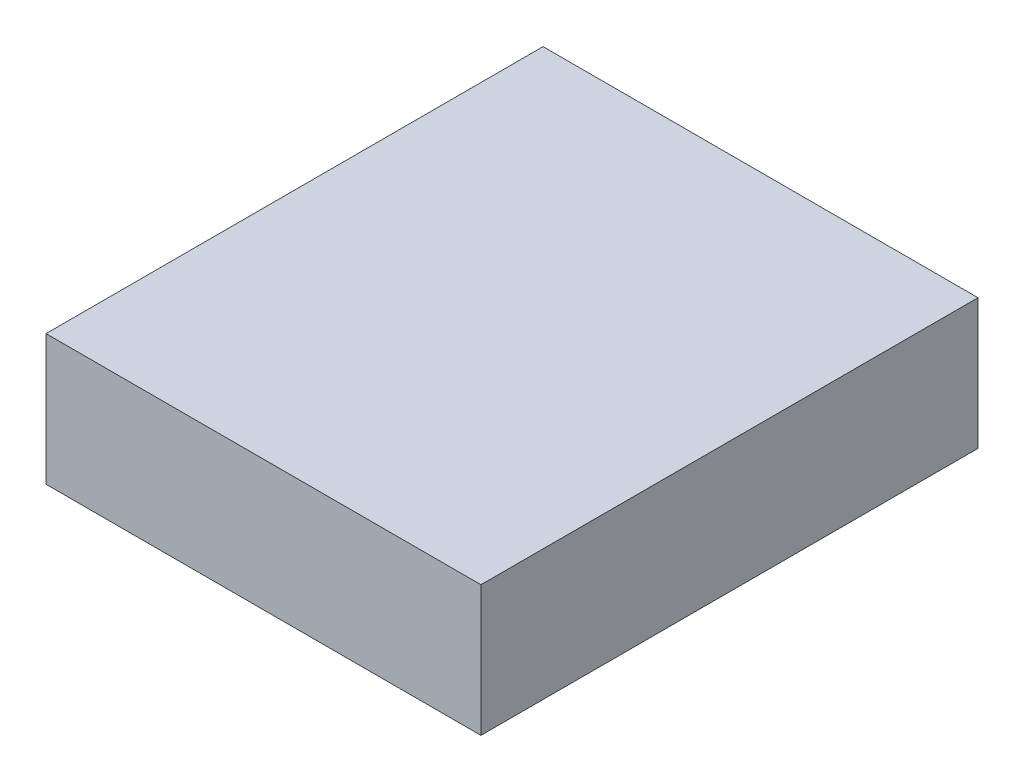
ISO-10303-21;
HEADER;
FILE_DESCRIPTION(('STEP AP214'),'2;1');
FILE_NAME('part.step','',(''),(''),'','','');
FILE_SCHEMA(('AUTOMOTIVE_DESIGN { 1 0 10303 214 1 1 1 1 }'));
ENDSEC;
DATA;
#1=APPLICATION_CONTEXT('core data for automotive mechanical design processes');
#2=APPLICATION_PROTOCOL_DEFINITION('international standard','automotive_design',2000,#1);
#3=PRODUCT_CONTEXT('',#1,'mechanical');
#4=PRODUCT('Part','Part','',(#3));
#5=PRODUCT_RELATED_PRODUCT_CATEGORY('part','',(#4));
#6=PRODUCT_DEFINITION_FORMATION('','',#4);
#7=PRODUCT_DEFINITION_CONTEXT('part definition',#1,'design');
#8=PRODUCT_DEFINITION('design','',#6,#7);
#9=PRODUCT_DEFINITION_SHAPE('','',#8);
#10=(LENGTH_UNIT() NAMED_UNIT(*) SI_UNIT(.MILLI.,.METRE.));
#11=(NAMED_UNIT(*) PLANE_ANGLE_UNIT() SI_UNIT($,.RADIAN.));
#12=(NAMED_UNIT(*) SI_UNIT($,.STERADIAN.) SOLID_ANGLE_UNIT());
#13=UNCERTAINTY_MEASURE_WITH_UNIT(LENGTH_MEASURE(1.E-05),#10,'distance_accuracy_value','');
#14=(GEOMETRIC_REPRESENTATION_CONTEXT(3) GLOBAL_UNCERTAINTY_ASSIGNED_CONTEXT((#13)) GLOBAL_UNIT_ASSIGNED_CONTEXT((#10,
#11,#12)) REPRESENTATION_CONTEXT('',''));
#15=CARTESIAN_POINT('',(0.,0.,0.));
#16=DIRECTION('',(0.,0.,1.));
#17=DIRECTION('',(1.,0.,0.));
#18=AXIS2_PLACEMENT_3D('',#15,#16,#17);
#19=CARTESIAN_POINT('',(-1.75,1.05,-2.));
#20=DIRECTION('',(1.,0.,0.));
#21=DIRECTION('',(0.,0.,-1.));
#22=AXIS2_PLACEMENT_3D('',#19,#20,#21);
#23=PLANE('',#22);
#24=DIRECTION('',(0.,0.,1.));
#25=VECTOR('',#24,1.);
#26=CARTESIAN_POINT('',(-1.75,0.,-2.));
#27=LINE('',#26,#25);
#28=CARTESIAN_POINT('',(-1.75,0.,-2.));
#29=VERTEX_POINT('',#28);
#30=CARTESIAN_POINT('',(-1.75,0.,2.));
#31=VERTEX_POINT('',#30);
#32=EDGE_CURVE('E96',#29,#31,#27,.T.);
#33=ORIENTED_EDGE('',*,*,#32,.T.);
#34=DIRECTION('',(0.,-1.,0.));
#35=VECTOR('',#34,1.);
#36=CARTESIAN_POINT('',(-1.75,1.05,2.));
#37=LINE('',#36,#35);
#38=CARTESIAN_POINT('',(-1.75,1.05,2.));
#39=VERTEX_POINT('',#38);
#40=EDGE_CURVE('E11',#39,#31,#37,.T.);
#41=ORIENTED_EDGE('',*,*,#40,.F.);
#42=DIRECTION('',(0.,0.,1.));
#43=VECTOR('',#42,1.);
#44=CARTESIAN_POINT('',(-1.75,1.05,-2.));
#45=LINE('',#44,#43);
#46=CARTESIAN_POINT('',(-1.75,1.05,-2.));
#47=VERTEX_POINT('',#46);
#48=EDGE_CURVE('E84',#47,#39,#45,.T.);
#49=ORIENTED_EDGE('',*,*,#48,.F.);
#50=DIRECTION('',(0.,-1.,0.));
#51=VECTOR('',#50,1.);
#52=CARTESIAN_POINT('',(-1.75,1.05,-2.));
#53=LINE('',#52,#51);
#54=EDGE_CURVE('E92',#47,#29,#53,.T.);
#55=ORIENTED_EDGE('',*,*,#54,.T.);
#56=EDGE_LOOP('',(#33,#41,#49,#55));
#57=FACE_BOUND('',#56,.T.);
#58=ADVANCED_FACE('F33',(#57),#23,.F.);
#59=CARTESIAN_POINT('',(1.75,1.05,2.));
#60=DIRECTION('',(0.,0.,-1.));
#61=DIRECTION('',(-1.,0.,0.));
#62=AXIS2_PLACEMENT_3D('',#59,#60,#61);
#63=PLANE('',#62);
#64=DIRECTION('',(1.,0.,0.));
#65=VECTOR('',#64,1.);
#66=CARTESIAN_POINT('',(1.75,0.,2.));
#67=LINE('',#66,#65);
#68=CARTESIAN_POINT('',(1.75,0.,2.));
#69=VERTEX_POINT('',#68);
#70=EDGE_CURVE('E88',#31,#69,#67,.T.);
#71=ORIENTED_EDGE('',*,*,#70,.T.);
#72=DIRECTION('',(0.,-1.,0.));
#73=VECTOR('',#72,1.);
#74=CARTESIAN_POINT('',(1.75,1.05,2.));
#75=LINE('',#74,#73);
#76=CARTESIAN_POINT('',(1.75,1.05,2.));
#77=VERTEX_POINT('',#76);
#78=EDGE_CURVE('E41',#77,#69,#75,.T.);
#79=ORIENTED_EDGE('',*,*,#78,.F.);
#80=DIRECTION('',(1.,0.,0.));
#81=VECTOR('',#80,1.);
#82=CARTESIAN_POINT('',(1.75,1.05,2.));
#83=LINE('',#82,#81);
#84=EDGE_CURVE('E79',#39,#77,#83,.T.);
#85=ORIENTED_EDGE('',*,*,#84,.F.);
#86=ORIENTED_EDGE('',*,*,#40,.T.);
#87=EDGE_LOOP('',(#71,#79,#85,#86));
#88=FACE_BOUND('',#87,.T.);
#89=ADVANCED_FACE('F87',(#88),#63,.F.);
#90=CARTESIAN_POINT('',(1.75,1.05,-2.));
#91=DIRECTION('',(-1.,0.,0.));
#92=DIRECTION('',(0.,0.,1.));
#93=AXIS2_PLACEMENT_3D('',#90,#91,#92);
#94=PLANE('',#93);
#95=DIRECTION('',(0.,0.,-1.));
#96=VECTOR('',#95,1.);
#97=CARTESIAN_POINT('',(1.75,0.,-2.));
#98=LINE('',#97,#96);
#99=CARTESIAN_POINT('',(1.75,0.,-2.));
#100=VERTEX_POINT('',#99);
#101=EDGE_CURVE('E66',#69,#100,#98,.T.);
#102=ORIENTED_EDGE('',*,*,#101,.T.);
#103=DIRECTION('',(0.,-1.,0.));
#104=VECTOR('',#103,1.);
#105=CARTESIAN_POINT('',(1.75,1.05,-2.));
#106=LINE('',#105,#104);
#107=CARTESIAN_POINT('',(1.75,1.05,-2.));
#108=VERTEX_POINT('',#107);
#109=EDGE_CURVE('E89',#108,#100,#106,.T.);
#110=ORIENTED_EDGE('',*,*,#109,.F.);
#111=DIRECTION('',(0.,0.,-1.));
#112=VECTOR('',#111,1.);
#113=CARTESIAN_POINT('',(1.75,1.05,-2.));
#114=LINE('',#113,#112);
#115=EDGE_CURVE('E82',#77,#108,#114,.T.);
#116=ORIENTED_EDGE('',*,*,#115,.F.);
#117=ORIENTED_EDGE('',*,*,#78,.T.);
#118=EDGE_LOOP('',(#102,#110,#116,#117));
#119=FACE_BOUND('',#118,.T.);
#120=ADVANCED_FACE('F90',(#119),#94,.F.);
#121=CARTESIAN_POINT('',(1.75,1.05,-2.));
#122=DIRECTION('',(0.,0.,1.));
#123=DIRECTION('',(1.,0.,0.));
#124=AXIS2_PLACEMENT_3D('',#121,#122,#123);
#125=PLANE('',#124);
#126=DIRECTION('',(-1.,0.,0.));
#127=VECTOR('',#126,1.);
#128=CARTESIAN_POINT('',(1.75,0.,-2.));
#129=LINE('',#128,#127);
#130=EDGE_CURVE('E72',#100,#29,#129,.T.);
#131=ORIENTED_EDGE('',*,*,#130,.T.);
#132=ORIENTED_EDGE('',*,*,#54,.F.);
#133=DIRECTION('',(-1.,0.,0.));
#134=VECTOR('',#133,1.);
#135=CARTESIAN_POINT('',(1.75,1.05,-2.));
#136=LINE('',#135,#134);
#137=EDGE_CURVE('E49',#108,#47,#136,.T.);
#138=ORIENTED_EDGE('',*,*,#137,.F.);
#139=ORIENTED_EDGE('',*,*,#109,.T.);
#140=EDGE_LOOP('',(#131,#132,#138,#139));
#141=FACE_BOUND('',#140,.T.);
#142=ADVANCED_FACE('F103',(#141),#125,.F.);
#143=CARTESIAN_POINT('',(0.,1.05,0.));
#144=DIRECTION('',(0.,-1.,0.));
#145=DIRECTION('',(0.,0.,-1.));
#146=AXIS2_PLACEMENT_3D('',#143,#144,#145);
#147=PLANE('',#146);
#148=ORIENTED_EDGE('',*,*,#48,.T.);
#149=ORIENTED_EDGE('',*,*,#84,.T.);
#150=ORIENTED_EDGE('',*,*,#115,.T.);
#151=ORIENTED_EDGE('',*,*,#137,.T.);
#152=EDGE_LOOP('',(#148,#149,#150,#151));
#153=FACE_BOUND('',#152,.T.);
#154=ADVANCED_FACE('F80',(#153),#147,.F.);
#155=CARTESIAN_POINT('',(0.,0.,0.));
#156=DIRECTION('',(0.,-1.,0.));
#157=DIRECTION('',(0.,0.,-1.));
#158=AXIS2_PLACEMENT_3D('',#155,#156,#157);
#159=PLANE('',#158);
#160=ORIENTED_EDGE('',*,*,#32,.F.);
#161=ORIENTED_EDGE('',*,*,#130,.F.);
#162=ORIENTED_EDGE('',*,*,#101,.F.);
#163=ORIENTED_EDGE('',*,*,#70,.F.);
#164=EDGE_LOOP('',(#160,#161,#162,#163));
#165=FACE_BOUND('',#164,.T.);
#166=ADVANCED_FACE('F106',(#165),#159,.T.);
#167=CLOSED_SHELL('',(#58,#89,#120,#142,#154,#166));
#168=MANIFOLD_SOLID_BREP('B2',#167);
#169=ADVANCED_BREP_SHAPE_REPRESENTATION('',(#18,#168),#14);
#170=SHAPE_DEFINITION_REPRESENTATION(#9,#169);
ENDSEC;
END-ISO-10303-21;
